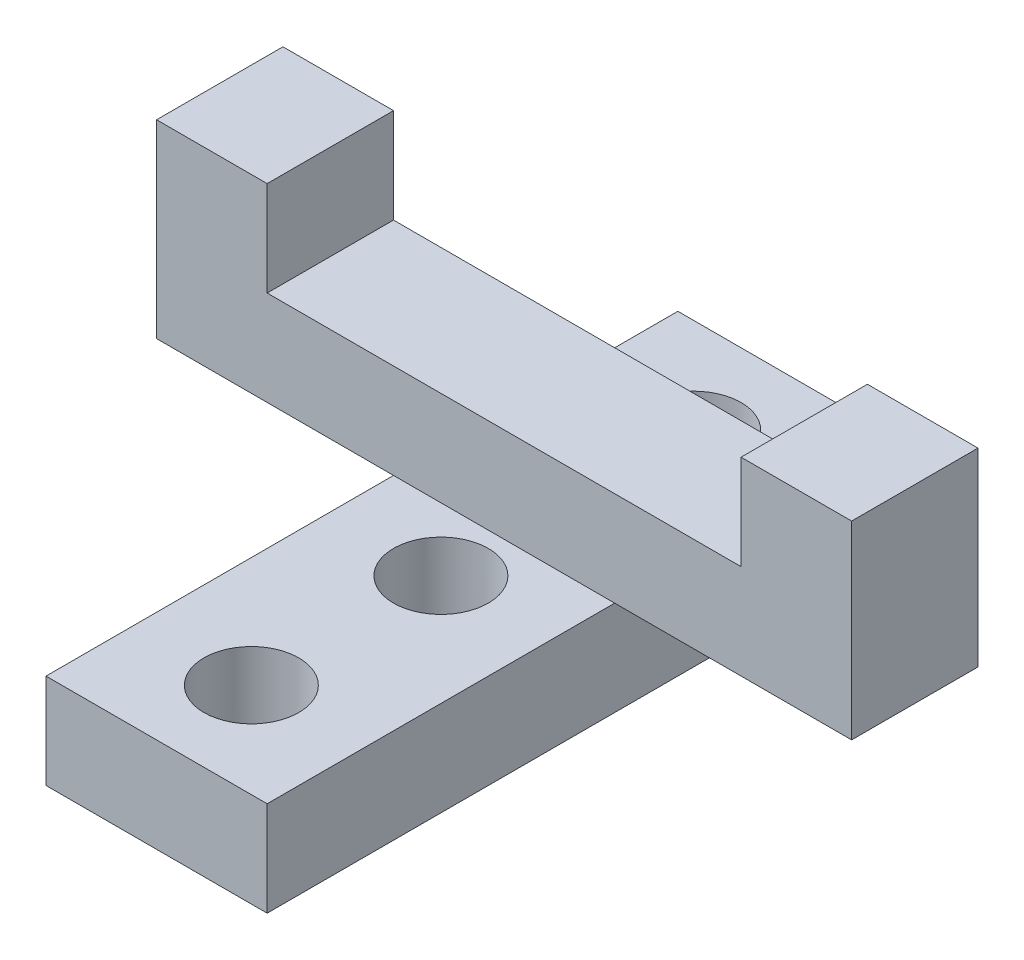
ISO-10303-21;
HEADER;
FILE_DESCRIPTION(('STEP AP214'),'2;1');
FILE_NAME('part.step','',(''),(''),'','','');
FILE_SCHEMA(('AUTOMOTIVE_DESIGN { 1 0 10303 214 1 1 1 1 }'));
ENDSEC;
DATA;
#1=APPLICATION_CONTEXT('core data for automotive mechanical design processes');
#2=APPLICATION_PROTOCOL_DEFINITION('international standard','automotive_design',2000,#1);
#3=PRODUCT_CONTEXT('',#1,'mechanical');
#4=PRODUCT('Part','Part','',(#3));
#5=PRODUCT_RELATED_PRODUCT_CATEGORY('part','',(#4));
#6=PRODUCT_DEFINITION_FORMATION('','',#4);
#7=PRODUCT_DEFINITION_CONTEXT('part definition',#1,'design');
#8=PRODUCT_DEFINITION('design','',#6,#7);
#9=PRODUCT_DEFINITION_SHAPE('','',#8);
#10=(LENGTH_UNIT() NAMED_UNIT(*) SI_UNIT(.MILLI.,.METRE.));
#11=(NAMED_UNIT(*) PLANE_ANGLE_UNIT() SI_UNIT($,.RADIAN.));
#12=(NAMED_UNIT(*) SI_UNIT($,.STERADIAN.) SOLID_ANGLE_UNIT());
#13=UNCERTAINTY_MEASURE_WITH_UNIT(LENGTH_MEASURE(1.E-05),#10,'distance_accuracy_value','');
#14=(GEOMETRIC_REPRESENTATION_CONTEXT(3) GLOBAL_UNCERTAINTY_ASSIGNED_CONTEXT((#13)) GLOBAL_UNIT_ASSIGNED_CONTEXT((#10,
#11,#12)) REPRESENTATION_CONTEXT('',''));
#15=CARTESIAN_POINT('',(0.,0.,0.));
#16=DIRECTION('',(0.,0.,1.));
#17=DIRECTION('',(1.,0.,0.));
#18=AXIS2_PLACEMENT_3D('',#15,#16,#17);
#19=CARTESIAN_POINT('',(-3.5,9.,-1.00000000000001));
#20=DIRECTION('',(0.,1.,0.));
#21=DIRECTION('',(0.,0.,1.));
#22=AXIS2_PLACEMENT_3D('',#19,#20,#21);
#23=PLANE('',#22);
#24=DIRECTION('',(0.,0.,1.));
#25=VECTOR('',#24,1.);
#26=CARTESIAN_POINT('',(-7.5,9.,-5.00000000000001));
#27=LINE('',#26,#25);
#28=CARTESIAN_POINT('',(-7.5,9.,-5.00000000000001));
#29=VERTEX_POINT('',#28);
#30=CARTESIAN_POINT('',(-7.5,9.,-1.));
#31=VERTEX_POINT('',#30);
#32=EDGE_CURVE('E140',#29,#31,#27,.T.);
#33=ORIENTED_EDGE('',*,*,#32,.F.);
#34=DIRECTION('',(-1.,0.,0.));
#35=VECTOR('',#34,1.);
#36=CARTESIAN_POINT('',(-3.5,9.,-5.00000000000001));
#37=LINE('',#36,#35);
#38=CARTESIAN_POINT('',(-11.,9.,-5.00000000000001));
#39=VERTEX_POINT('',#38);
#40=EDGE_CURVE('E222',#29,#39,#37,.T.);
#41=ORIENTED_EDGE('',*,*,#40,.T.);
#42=DIRECTION('',(0.,0.,-1.));
#43=VECTOR('',#42,1.);
#44=CARTESIAN_POINT('',(-11.,9.,-1.));
#45=LINE('',#44,#43);
#46=CARTESIAN_POINT('',(-11.,9.,-1.));
#47=VERTEX_POINT('',#46);
#48=EDGE_CURVE('E173',#47,#39,#45,.T.);
#49=ORIENTED_EDGE('',*,*,#48,.F.);
#50=DIRECTION('',(1.,0.,0.));
#51=VECTOR('',#50,1.);
#52=CARTESIAN_POINT('',(-3.5,9.,-1.00000000000001));
#53=LINE('',#52,#51);
#54=EDGE_CURVE('E220',#47,#31,#53,.T.);
#55=ORIENTED_EDGE('',*,*,#54,.T.);
#56=EDGE_LOOP('',(#33,#41,#49,#55));
#57=FACE_BOUND('',#56,.T.);
#58=ADVANCED_FACE('F31',(#57),#23,.T.);
#59=CARTESIAN_POINT('',(-3.5,3.,9.99999999999999));
#60=DIRECTION('',(1.,0.,0.));
#61=DIRECTION('',(0.,0.,-1.));
#62=AXIS2_PLACEMENT_3D('',#59,#60,#61);
#63=PLANE('',#62);
#64=DIRECTION('',(0.,0.,1.));
#65=VECTOR('',#64,1.);
#66=CARTESIAN_POINT('',(-3.5,3.,-1.));
#67=LINE('',#66,#65);
#68=CARTESIAN_POINT('',(-3.5,3.,-5.));
#69=VERTEX_POINT('',#68);
#70=CARTESIAN_POINT('',(-3.5,3.,-1.));
#71=VERTEX_POINT('',#70);
#72=EDGE_CURVE('E56',#69,#71,#67,.T.);
#73=ORIENTED_EDGE('',*,*,#72,.F.);
#74=DIRECTION('',(0.,0.,1.));
#75=VECTOR('',#74,1.);
#76=CARTESIAN_POINT('',(-3.5,3.,9.99999999999999));
#77=LINE('',#76,#75);
#78=CARTESIAN_POINT('',(-3.5,3.,-10.));
#79=VERTEX_POINT('',#78);
#80=EDGE_CURVE('E238',#79,#69,#77,.T.);
#81=ORIENTED_EDGE('',*,*,#80,.F.);
#82=DIRECTION('',(0.,-1.,0.));
#83=VECTOR('',#82,1.);
#84=CARTESIAN_POINT('',(-3.5,3.,-10.));
#85=LINE('',#84,#83);
#86=CARTESIAN_POINT('',(-3.5,0.,-10.));
#87=VERTEX_POINT('',#86);
#88=EDGE_CURVE('E40',#79,#87,#85,.T.);
#89=ORIENTED_EDGE('',*,*,#88,.T.);
#90=DIRECTION('',(0.,0.,1.));
#91=VECTOR('',#90,1.);
#92=CARTESIAN_POINT('',(-3.5,0.,9.99999999999999));
#93=LINE('',#92,#91);
#94=CARTESIAN_POINT('',(-3.5,0.,9.99999999999999));
#95=VERTEX_POINT('',#94);
#96=EDGE_CURVE('E255',#87,#95,#93,.T.);
#97=ORIENTED_EDGE('',*,*,#96,.T.);
#98=DIRECTION('',(0.,-1.,0.));
#99=VECTOR('',#98,1.);
#100=CARTESIAN_POINT('',(-3.5,3.,9.99999999999999));
#101=LINE('',#100,#99);
#102=CARTESIAN_POINT('',(-3.5,3.,9.99999999999999));
#103=VERTEX_POINT('',#102);
#104=EDGE_CURVE('E262',#103,#95,#101,.T.);
#105=ORIENTED_EDGE('',*,*,#104,.F.);
#106=EDGE_CURVE('E235',#71,#103,#77,.T.);
#107=ORIENTED_EDGE('',*,*,#106,.F.);
#108=EDGE_LOOP('',(#73,#81,#89,#97,#105,#107));
#109=FACE_BOUND('',#108,.T.);
#110=ADVANCED_FACE('F336',(#109),#63,.F.);
#111=CARTESIAN_POINT('',(3.5,3.,9.99999999999999));
#112=DIRECTION('',(-1.,0.,0.));
#113=DIRECTION('',(0.,0.,1.));
#114=AXIS2_PLACEMENT_3D('',#111,#112,#113);
#115=PLANE('',#114);
#116=DIRECTION('',(0.,0.,-1.));
#117=VECTOR('',#116,1.);
#118=CARTESIAN_POINT('',(3.5,3.,-1.));
#119=LINE('',#118,#117);
#120=CARTESIAN_POINT('',(3.5,3.,-1.));
#121=VERTEX_POINT('',#120);
#122=CARTESIAN_POINT('',(3.5,3.,-5.00000000000001));
#123=VERTEX_POINT('',#122);
#124=EDGE_CURVE('E195',#121,#123,#119,.T.);
#125=ORIENTED_EDGE('',*,*,#124,.F.);
#126=DIRECTION('',(0.,0.,-1.));
#127=VECTOR('',#126,1.);
#128=CARTESIAN_POINT('',(3.5,3.,9.99999999999999));
#129=LINE('',#128,#127);
#130=CARTESIAN_POINT('',(3.5,3.,9.99999999999999));
#131=VERTEX_POINT('',#130);
#132=EDGE_CURVE('E277',#131,#121,#129,.T.);
#133=ORIENTED_EDGE('',*,*,#132,.F.);
#134=DIRECTION('',(0.,-1.,0.));
#135=VECTOR('',#134,1.);
#136=CARTESIAN_POINT('',(3.5,3.,9.99999999999999));
#137=LINE('',#136,#135);
#138=CARTESIAN_POINT('',(3.5,0.,9.99999999999999));
#139=VERTEX_POINT('',#138);
#140=EDGE_CURVE('E248',#131,#139,#137,.T.);
#141=ORIENTED_EDGE('',*,*,#140,.T.);
#142=DIRECTION('',(0.,0.,-1.));
#143=VECTOR('',#142,1.);
#144=CARTESIAN_POINT('',(3.5,0.,9.99999999999999));
#145=LINE('',#144,#143);
#146=CARTESIAN_POINT('',(3.5,0.,-10.));
#147=VERTEX_POINT('',#146);
#148=EDGE_CURVE('E249',#139,#147,#145,.T.);
#149=ORIENTED_EDGE('',*,*,#148,.T.);
#150=DIRECTION('',(0.,-1.,0.));
#151=VECTOR('',#150,1.);
#152=CARTESIAN_POINT('',(3.5,3.,-10.));
#153=LINE('',#152,#151);
#154=CARTESIAN_POINT('',(3.5,3.,-10.));
#155=VERTEX_POINT('',#154);
#156=EDGE_CURVE('E11',#155,#147,#153,.T.);
#157=ORIENTED_EDGE('',*,*,#156,.F.);
#158=EDGE_CURVE('E259',#123,#155,#129,.T.);
#159=ORIENTED_EDGE('',*,*,#158,.F.);
#160=EDGE_LOOP('',(#125,#133,#141,#149,#157,#159));
#161=FACE_BOUND('',#160,.T.);
#162=ADVANCED_FACE('F33',(#161),#115,.F.);
#163=CARTESIAN_POINT('',(3.5,3.,-10.));
#164=DIRECTION('',(0.,-1.,0.));
#165=DIRECTION('',(0.,0.,-1.));
#166=AXIS2_PLACEMENT_3D('',#163,#164,#165);
#167=PLANE('',#166);
#168=CARTESIAN_POINT('',(0.,3.,-7.));
#169=DIRECTION('',(0.,1.,0.));
#170=DIRECTION('',(0.,0.,1.));
#171=AXIS2_PLACEMENT_3D('',#168,#169,#170);
#172=CIRCLE('',#171,1.5);
#173=CARTESIAN_POINT('',(0.,3.,-5.50000000000001));
#174=VERTEX_POINT('',#173);
#175=EDGE_CURVE('E269',#174,#174,#172,.T.);
#176=ORIENTED_EDGE('',*,*,#175,.F.);
#177=EDGE_LOOP('',(#176));
#178=FACE_BOUND('',#177,.T.);
#179=DIRECTION('',(-1.,0.,0.));
#180=VECTOR('',#179,1.);
#181=CARTESIAN_POINT('',(-3.5,3.,-5.00000000000001));
#182=LINE('',#181,#180);
#183=EDGE_CURVE('E210',#123,#69,#182,.T.);
#184=ORIENTED_EDGE('',*,*,#183,.F.);
#185=ORIENTED_EDGE('',*,*,#158,.T.);
#186=DIRECTION('',(-1.,0.,0.));
#187=VECTOR('',#186,1.);
#188=CARTESIAN_POINT('',(-3.5,3.,-10.));
#189=LINE('',#188,#187);
#190=EDGE_CURVE('E239',#155,#79,#189,.T.);
#191=ORIENTED_EDGE('',*,*,#190,.T.);
#192=ORIENTED_EDGE('',*,*,#80,.T.);
#193=EDGE_LOOP('',(#184,#185,#191,#192));
#194=FACE_BOUND('',#193,.T.);
#195=ADVANCED_FACE('F294',(#178,#194),#167,.F.);
#196=CARTESIAN_POINT('',(0.,3.,0.999999999999995));
#197=DIRECTION('',(0.,1.,0.));
#198=DIRECTION('',(0.,0.,1.));
#199=AXIS2_PLACEMENT_3D('',#196,#197,#198);
#200=CIRCLE('',#199,1.5);
#201=CARTESIAN_POINT('',(0.,3.,2.49999999999999));
#202=VERTEX_POINT('',#201);
#203=EDGE_CURVE('E273',#202,#202,#200,.T.);
#204=ORIENTED_EDGE('',*,*,#203,.F.);
#205=EDGE_LOOP('',(#204));
#206=FACE_BOUND('',#205,.T.);
#207=CARTESIAN_POINT('',(0.,3.,6.99999999999999));
#208=DIRECTION('',(0.,1.,0.));
#209=DIRECTION('',(0.,0.,1.));
#210=AXIS2_PLACEMENT_3D('',#207,#208,#209);
#211=CIRCLE('',#210,1.5);
#212=CARTESIAN_POINT('',(0.,3.,8.49999999999999));
#213=VERTEX_POINT('',#212);
#214=EDGE_CURVE('E227',#213,#213,#211,.T.);
#215=ORIENTED_EDGE('',*,*,#214,.F.);
#216=EDGE_LOOP('',(#215));
#217=FACE_BOUND('',#216,.T.);
#218=DIRECTION('',(1.,0.,0.));
#219=VECTOR('',#218,1.);
#220=CARTESIAN_POINT('',(-3.5,3.,-1.00000000000001));
#221=LINE('',#220,#219);
#222=EDGE_CURVE('E231',#71,#121,#221,.T.);
#223=ORIENTED_EDGE('',*,*,#222,.F.);
#224=ORIENTED_EDGE('',*,*,#106,.T.);
#225=DIRECTION('',(1.,0.,0.));
#226=VECTOR('',#225,1.);
#227=CARTESIAN_POINT('',(-3.5,3.,9.99999999999999));
#228=LINE('',#227,#226);
#229=EDGE_CURVE('E245',#103,#131,#228,.T.);
#230=ORIENTED_EDGE('',*,*,#229,.T.);
#231=ORIENTED_EDGE('',*,*,#132,.T.);
#232=EDGE_LOOP('',(#223,#224,#230,#231));
#233=FACE_BOUND('',#232,.T.);
#234=ADVANCED_FACE('F290',(#206,#217,#233),#167,.F.);
#235=CARTESIAN_POINT('',(-3.5,3.,-10.));
#236=DIRECTION('',(0.,0.,1.));
#237=DIRECTION('',(1.,0.,0.));
#238=AXIS2_PLACEMENT_3D('',#235,#236,#237);
#239=PLANE('',#238);
#240=DIRECTION('',(-1.,0.,0.));
#241=VECTOR('',#240,1.);
#242=CARTESIAN_POINT('',(-3.5,0.,-10.));
#243=LINE('',#242,#241);
#244=EDGE_CURVE('E252',#147,#87,#243,.T.);
#245=ORIENTED_EDGE('',*,*,#244,.T.);
#246=ORIENTED_EDGE('',*,*,#88,.F.);
#247=ORIENTED_EDGE('',*,*,#190,.F.);
#248=ORIENTED_EDGE('',*,*,#156,.T.);
#249=EDGE_LOOP('',(#245,#246,#247,#248));
#250=FACE_BOUND('',#249,.T.);
#251=ADVANCED_FACE('F293',(#250),#239,.F.);
#252=CARTESIAN_POINT('',(-3.5,3.,9.99999999999999));
#253=DIRECTION('',(0.,0.,-1.));
#254=DIRECTION('',(-1.,0.,0.));
#255=AXIS2_PLACEMENT_3D('',#252,#253,#254);
#256=PLANE('',#255);
#257=DIRECTION('',(1.,0.,0.));
#258=VECTOR('',#257,1.);
#259=CARTESIAN_POINT('',(-3.5,0.,9.99999999999999));
#260=LINE('',#259,#258);
#261=EDGE_CURVE('E257',#95,#139,#260,.T.);
#262=ORIENTED_EDGE('',*,*,#261,.T.);
#263=ORIENTED_EDGE('',*,*,#140,.F.);
#264=ORIENTED_EDGE('',*,*,#229,.F.);
#265=ORIENTED_EDGE('',*,*,#104,.T.);
#266=EDGE_LOOP('',(#262,#263,#264,#265));
#267=FACE_BOUND('',#266,.T.);
#268=ADVANCED_FACE('F371',(#267),#256,.F.);
#269=CARTESIAN_POINT('',(3.5,0.,-10.));
#270=DIRECTION('',(0.,-1.,0.));
#271=DIRECTION('',(0.,0.,-1.));
#272=AXIS2_PLACEMENT_3D('',#269,#270,#271);
#273=PLANE('',#272);
#274=CARTESIAN_POINT('',(0.,0.,6.99999999999999));
#275=DIRECTION('',(0.,-1.,0.));
#276=DIRECTION('',(0.,0.,-1.));
#277=AXIS2_PLACEMENT_3D('',#274,#275,#276);
#278=CIRCLE('',#277,1.5);
#279=CARTESIAN_POINT('',(0.,0.,5.5));
#280=VERTEX_POINT('',#279);
#281=EDGE_CURVE('E274',#280,#280,#278,.T.);
#282=ORIENTED_EDGE('',*,*,#281,.F.);
#283=EDGE_LOOP('',(#282));
#284=FACE_BOUND('',#283,.T.);
#285=CARTESIAN_POINT('',(0.,0.,0.999999999999995));
#286=DIRECTION('',(0.,-1.,0.));
#287=DIRECTION('',(0.,0.,-1.));
#288=AXIS2_PLACEMENT_3D('',#285,#286,#287);
#289=CIRCLE('',#288,1.5);
#290=CARTESIAN_POINT('',(0.,0.,-0.500000000000003));
#291=VERTEX_POINT('',#290);
#292=EDGE_CURVE('E270',#291,#291,#289,.T.);
#293=ORIENTED_EDGE('',*,*,#292,.F.);
#294=EDGE_LOOP('',(#293));
#295=FACE_BOUND('',#294,.T.);
#296=CARTESIAN_POINT('',(0.,0.,-7.));
#297=DIRECTION('',(0.,-1.,0.));
#298=DIRECTION('',(0.,0.,-1.));
#299=AXIS2_PLACEMENT_3D('',#296,#297,#298);
#300=CIRCLE('',#299,1.5);
#301=CARTESIAN_POINT('',(0.,0.,-8.5));
#302=VERTEX_POINT('',#301);
#303=EDGE_CURVE('E253',#302,#302,#300,.T.);
#304=ORIENTED_EDGE('',*,*,#303,.F.);
#305=EDGE_LOOP('',(#304));
#306=FACE_BOUND('',#305,.T.);
#307=ORIENTED_EDGE('',*,*,#148,.F.);
#308=ORIENTED_EDGE('',*,*,#261,.F.);
#309=ORIENTED_EDGE('',*,*,#96,.F.);
#310=ORIENTED_EDGE('',*,*,#244,.F.);
#311=EDGE_LOOP('',(#307,#308,#309,#310));
#312=FACE_BOUND('',#311,.T.);
#313=ADVANCED_FACE('F364',(#284,#295,#306,#312),#273,.T.);
#314=CARTESIAN_POINT('',(0.,3.,-7.));
#315=DIRECTION('',(0.,1.,0.));
#316=DIRECTION('',(0.,0.,1.));
#317=AXIS2_PLACEMENT_3D('',#314,#315,#316);
#318=CYLINDRICAL_SURFACE('',#317,1.5);
#319=ORIENTED_EDGE('',*,*,#303,.T.);
#320=EDGE_LOOP('',(#319));
#321=FACE_BOUND('',#320,.T.);
#322=ORIENTED_EDGE('',*,*,#175,.T.);
#323=EDGE_LOOP('',(#322));
#324=FACE_BOUND('',#323,.T.);
#325=ADVANCED_FACE('F361',(#321,#324),#318,.F.);
#326=CARTESIAN_POINT('',(0.,3.,0.999999999999995));
#327=DIRECTION('',(0.,1.,0.));
#328=DIRECTION('',(0.,0.,1.));
#329=AXIS2_PLACEMENT_3D('',#326,#327,#328);
#330=CYLINDRICAL_SURFACE('',#329,1.5);
#331=ORIENTED_EDGE('',*,*,#292,.T.);
#332=EDGE_LOOP('',(#331));
#333=FACE_BOUND('',#332,.T.);
#334=ORIENTED_EDGE('',*,*,#203,.T.);
#335=EDGE_LOOP('',(#334));
#336=FACE_BOUND('',#335,.T.);
#337=ADVANCED_FACE('F357',(#333,#336),#330,.F.);
#338=CARTESIAN_POINT('',(0.,3.,6.99999999999999));
#339=DIRECTION('',(0.,1.,0.));
#340=DIRECTION('',(0.,0.,1.));
#341=AXIS2_PLACEMENT_3D('',#338,#339,#340);
#342=CYLINDRICAL_SURFACE('',#341,1.5);
#343=ORIENTED_EDGE('',*,*,#281,.T.);
#344=EDGE_LOOP('',(#343));
#345=FACE_BOUND('',#344,.T.);
#346=ORIENTED_EDGE('',*,*,#214,.T.);
#347=EDGE_LOOP('',(#346));
#348=FACE_BOUND('',#347,.T.);
#349=ADVANCED_FACE('F288',(#345,#348),#342,.F.);
#350=CARTESIAN_POINT('',(-3.5,9.,-1.00000000000001));
#351=DIRECTION('',(0.,0.,-1.));
#352=DIRECTION('',(-1.,0.,0.));
#353=AXIS2_PLACEMENT_3D('',#350,#351,#352);
#354=PLANE('',#353);
#355=DIRECTION('',(1.,0.,0.));
#356=VECTOR('',#355,1.);
#357=CARTESIAN_POINT('',(-7.5,6.,-1.));
#358=LINE('',#357,#356);
#359=CARTESIAN_POINT('',(-7.5,6.,-1.));
#360=VERTEX_POINT('',#359);
#361=CARTESIAN_POINT('',(7.5,6.,-1.));
#362=VERTEX_POINT('',#361);
#363=EDGE_CURVE('E150',#360,#362,#358,.T.);
#364=ORIENTED_EDGE('',*,*,#363,.F.);
#365=DIRECTION('',(0.,1.,0.));
#366=VECTOR('',#365,1.);
#367=CARTESIAN_POINT('',(-7.5,6.,-1.));
#368=LINE('',#367,#366);
#369=EDGE_CURVE('E134',#360,#31,#368,.T.);
#370=ORIENTED_EDGE('',*,*,#369,.T.);
#371=ORIENTED_EDGE('',*,*,#54,.F.);
#372=DIRECTION('',(0.,1.,0.));
#373=VECTOR('',#372,1.);
#374=CARTESIAN_POINT('',(-11.,3.,-1.));
#375=LINE('',#374,#373);
#376=CARTESIAN_POINT('',(-11.,3.,-1.));
#377=VERTEX_POINT('',#376);
#378=EDGE_CURVE('E170',#377,#47,#375,.T.);
#379=ORIENTED_EDGE('',*,*,#378,.F.);
#380=DIRECTION('',(1.,0.,0.));
#381=VECTOR('',#380,1.);
#382=CARTESIAN_POINT('',(-11.,3.,-1.));
#383=LINE('',#382,#381);
#384=EDGE_CURVE('E180',#377,#71,#383,.T.);
#385=ORIENTED_EDGE('',*,*,#384,.T.);
#386=ORIENTED_EDGE('',*,*,#222,.T.);
#387=DIRECTION('',(-1.,0.,0.));
#388=VECTOR('',#387,1.);
#389=CARTESIAN_POINT('',(11.,3.,-1.));
#390=LINE('',#389,#388);
#391=CARTESIAN_POINT('',(11.,3.,-1.));
#392=VERTEX_POINT('',#391);
#393=EDGE_CURVE('E234',#392,#121,#390,.T.);
#394=ORIENTED_EDGE('',*,*,#393,.F.);
#395=DIRECTION('',(0.,-1.,0.));
#396=VECTOR('',#395,1.);
#397=CARTESIAN_POINT('',(11.,3.,-1.));
#398=LINE('',#397,#396);
#399=CARTESIAN_POINT('',(11.,9.,-1.));
#400=VERTEX_POINT('',#399);
#401=EDGE_CURVE('E183',#400,#392,#398,.T.);
#402=ORIENTED_EDGE('',*,*,#401,.F.);
#403=CARTESIAN_POINT('',(7.5,9.,-1.));
#404=VERTEX_POINT('',#403);
#405=EDGE_CURVE('E223',#404,#400,#53,.T.);
#406=ORIENTED_EDGE('',*,*,#405,.F.);
#407=DIRECTION('',(0.,1.,0.));
#408=VECTOR('',#407,1.);
#409=CARTESIAN_POINT('',(7.5,6.,-1.));
#410=LINE('',#409,#408);
#411=EDGE_CURVE('E48',#362,#404,#410,.T.);
#412=ORIENTED_EDGE('',*,*,#411,.F.);
#413=EDGE_LOOP('',(#364,#370,#371,#379,#385,#386,#394,#402,#406,#412));
#414=FACE_BOUND('',#413,.T.);
#415=ADVANCED_FACE('F155',(#414),#354,.F.);
#416=CARTESIAN_POINT('',(-3.5,9.,-5.00000000000001));
#417=DIRECTION('',(0.,0.,1.));
#418=DIRECTION('',(1.,0.,0.));
#419=AXIS2_PLACEMENT_3D('',#416,#417,#418);
#420=PLANE('',#419);
#421=ORIENTED_EDGE('',*,*,#40,.F.);
#422=DIRECTION('',(0.,1.,0.));
#423=VECTOR('',#422,1.);
#424=CARTESIAN_POINT('',(-7.5,6.,-5.00000000000001));
#425=LINE('',#424,#423);
#426=CARTESIAN_POINT('',(-7.5,6.,-5.00000000000001));
#427=VERTEX_POINT('',#426);
#428=EDGE_CURVE('E164',#427,#29,#425,.T.);
#429=ORIENTED_EDGE('',*,*,#428,.F.);
#430=DIRECTION('',(-1.,0.,0.));
#431=VECTOR('',#430,1.);
#432=CARTESIAN_POINT('',(-7.5,6.,-5.00000000000001));
#433=LINE('',#432,#431);
#434=CARTESIAN_POINT('',(7.5,6.,-5.00000000000001));
#435=VERTEX_POINT('',#434);
#436=EDGE_CURVE('E144',#435,#427,#433,.T.);
#437=ORIENTED_EDGE('',*,*,#436,.F.);
#438=DIRECTION('',(0.,1.,0.));
#439=VECTOR('',#438,1.);
#440=CARTESIAN_POINT('',(7.5,6.,-5.00000000000001));
#441=LINE('',#440,#439);
#442=CARTESIAN_POINT('',(7.5,9.,-5.00000000000001));
#443=VERTEX_POINT('',#442);
#444=EDGE_CURVE('E166',#435,#443,#441,.T.);
#445=ORIENTED_EDGE('',*,*,#444,.T.);
#446=CARTESIAN_POINT('',(11.,9.,-5.00000000000001));
#447=VERTEX_POINT('',#446);
#448=EDGE_CURVE('E224',#447,#443,#37,.T.);
#449=ORIENTED_EDGE('',*,*,#448,.F.);
#450=DIRECTION('',(0.,1.,0.));
#451=VECTOR('',#450,1.);
#452=CARTESIAN_POINT('',(11.,3.,-5.00000000000001));
#453=LINE('',#452,#451);
#454=CARTESIAN_POINT('',(11.,3.,-5.00000000000001));
#455=VERTEX_POINT('',#454);
#456=EDGE_CURVE('E323',#455,#447,#453,.T.);
#457=ORIENTED_EDGE('',*,*,#456,.F.);
#458=DIRECTION('',(-1.,0.,0.));
#459=VECTOR('',#458,1.);
#460=CARTESIAN_POINT('',(11.,3.,-5.00000000000001));
#461=LINE('',#460,#459);
#462=EDGE_CURVE('E213',#455,#123,#461,.T.);
#463=ORIENTED_EDGE('',*,*,#462,.T.);
#464=ORIENTED_EDGE('',*,*,#183,.T.);
#465=DIRECTION('',(1.,0.,0.));
#466=VECTOR('',#465,1.);
#467=CARTESIAN_POINT('',(-11.,3.,-5.00000000000001));
#468=LINE('',#467,#466);
#469=CARTESIAN_POINT('',(-11.,3.,-5.00000000000001));
#470=VERTEX_POINT('',#469);
#471=EDGE_CURVE('E192',#470,#69,#468,.T.);
#472=ORIENTED_EDGE('',*,*,#471,.F.);
#473=DIRECTION('',(0.,-1.,0.));
#474=VECTOR('',#473,1.);
#475=CARTESIAN_POINT('',(-11.,3.,-5.00000000000001));
#476=LINE('',#475,#474);
#477=EDGE_CURVE('E176',#39,#470,#476,.T.);
#478=ORIENTED_EDGE('',*,*,#477,.F.);
#479=EDGE_LOOP('',(#421,#429,#437,#445,#449,#457,#463,#464,#472,#478));
#480=FACE_BOUND('',#479,.T.);
#481=ADVANCED_FACE('F311',(#480),#420,.F.);
#482=DIRECTION('',(0.,0.,-1.));
#483=VECTOR('',#482,1.);
#484=CARTESIAN_POINT('',(7.5,9.,-5.00000000000001));
#485=LINE('',#484,#483);
#486=EDGE_CURVE('E153',#404,#443,#485,.T.);
#487=ORIENTED_EDGE('',*,*,#486,.F.);
#488=ORIENTED_EDGE('',*,*,#405,.T.);
#489=DIRECTION('',(0.,0.,1.));
#490=VECTOR('',#489,1.);
#491=CARTESIAN_POINT('',(11.,9.,-1.));
#492=LINE('',#491,#490);
#493=EDGE_CURVE('E218',#447,#400,#492,.T.);
#494=ORIENTED_EDGE('',*,*,#493,.F.);
#495=ORIENTED_EDGE('',*,*,#448,.T.);
#496=EDGE_LOOP('',(#487,#488,#494,#495));
#497=FACE_BOUND('',#496,.T.);
#498=ADVANCED_FACE('F318',(#497),#23,.T.);
#499=CARTESIAN_POINT('',(11.,3.,-1.));
#500=DIRECTION('',(0.,1.,0.));
#501=DIRECTION('',(0.,0.,1.));
#502=AXIS2_PLACEMENT_3D('',#499,#500,#501);
#503=PLANE('',#502);
#504=ORIENTED_EDGE('',*,*,#124,.T.);
#505=ORIENTED_EDGE('',*,*,#462,.F.);
#506=DIRECTION('',(0.,0.,-1.));
#507=VECTOR('',#506,1.);
#508=CARTESIAN_POINT('',(11.,3.,-1.));
#509=LINE('',#508,#507);
#510=EDGE_CURVE('E206',#392,#455,#509,.T.);
#511=ORIENTED_EDGE('',*,*,#510,.F.);
#512=ORIENTED_EDGE('',*,*,#393,.T.);
#513=EDGE_LOOP('',(#504,#505,#511,#512));
#514=FACE_BOUND('',#513,.T.);
#515=ADVANCED_FACE('F325',(#514),#503,.F.);
#516=CARTESIAN_POINT('',(11.,9.,-1.));
#517=DIRECTION('',(-1.,0.,0.));
#518=DIRECTION('',(0.,0.,1.));
#519=AXIS2_PLACEMENT_3D('',#516,#517,#518);
#520=PLANE('',#519);
#521=ORIENTED_EDGE('',*,*,#401,.T.);
#522=ORIENTED_EDGE('',*,*,#510,.T.);
#523=ORIENTED_EDGE('',*,*,#456,.T.);
#524=ORIENTED_EDGE('',*,*,#493,.T.);
#525=EDGE_LOOP('',(#521,#522,#523,#524));
#526=FACE_BOUND('',#525,.T.);
#527=ADVANCED_FACE('F322',(#526),#520,.F.);
#528=CARTESIAN_POINT('',(-11.,3.,-1.));
#529=DIRECTION('',(0.,1.,0.));
#530=DIRECTION('',(0.,0.,1.));
#531=AXIS2_PLACEMENT_3D('',#528,#529,#530);
#532=PLANE('',#531);
#533=ORIENTED_EDGE('',*,*,#72,.T.);
#534=ORIENTED_EDGE('',*,*,#384,.F.);
#535=DIRECTION('',(0.,0.,1.));
#536=VECTOR('',#535,1.);
#537=CARTESIAN_POINT('',(-11.,3.,-1.));
#538=LINE('',#537,#536);
#539=EDGE_CURVE('E178',#470,#377,#538,.T.);
#540=ORIENTED_EDGE('',*,*,#539,.F.);
#541=ORIENTED_EDGE('',*,*,#471,.T.);
#542=EDGE_LOOP('',(#533,#534,#540,#541));
#543=FACE_BOUND('',#542,.T.);
#544=ADVANCED_FACE('F302',(#543),#532,.F.);
#545=CARTESIAN_POINT('',(-11.,9.,-1.));
#546=DIRECTION('',(-1.,0.,0.));
#547=DIRECTION('',(0.,0.,1.));
#548=AXIS2_PLACEMENT_3D('',#545,#546,#547);
#549=PLANE('',#548);
#550=ORIENTED_EDGE('',*,*,#378,.T.);
#551=ORIENTED_EDGE('',*,*,#48,.T.);
#552=ORIENTED_EDGE('',*,*,#477,.T.);
#553=ORIENTED_EDGE('',*,*,#539,.T.);
#554=EDGE_LOOP('',(#550,#551,#552,#553));
#555=FACE_BOUND('',#554,.T.);
#556=ADVANCED_FACE('F306',(#555),#549,.T.);
#557=CARTESIAN_POINT('',(-7.5,6.,-5.00000000000001));
#558=DIRECTION('',(-1.,0.,0.));
#559=DIRECTION('',(0.,0.,1.));
#560=AXIS2_PLACEMENT_3D('',#557,#558,#559);
#561=PLANE('',#560);
#562=ORIENTED_EDGE('',*,*,#32,.T.);
#563=ORIENTED_EDGE('',*,*,#369,.F.);
#564=DIRECTION('',(0.,0.,1.));
#565=VECTOR('',#564,1.);
#566=CARTESIAN_POINT('',(-7.5,6.,-5.00000000000001));
#567=LINE('',#566,#565);
#568=EDGE_CURVE('E137',#427,#360,#567,.T.);
#569=ORIENTED_EDGE('',*,*,#568,.F.);
#570=ORIENTED_EDGE('',*,*,#428,.T.);
#571=EDGE_LOOP('',(#562,#563,#569,#570));
#572=FACE_BOUND('',#571,.T.);
#573=ADVANCED_FACE('F136',(#572),#561,.F.);
#574=CARTESIAN_POINT('',(7.5,6.,-5.00000000000001));
#575=DIRECTION('',(1.,0.,0.));
#576=DIRECTION('',(0.,0.,-1.));
#577=AXIS2_PLACEMENT_3D('',#574,#575,#576);
#578=PLANE('',#577);
#579=ORIENTED_EDGE('',*,*,#486,.T.);
#580=ORIENTED_EDGE('',*,*,#444,.F.);
#581=DIRECTION('',(0.,0.,-1.));
#582=VECTOR('',#581,1.);
#583=CARTESIAN_POINT('',(7.5,6.,-5.00000000000001));
#584=LINE('',#583,#582);
#585=EDGE_CURVE('E157',#362,#435,#584,.T.);
#586=ORIENTED_EDGE('',*,*,#585,.F.);
#587=ORIENTED_EDGE('',*,*,#411,.T.);
#588=EDGE_LOOP('',(#579,#580,#586,#587));
#589=FACE_BOUND('',#588,.T.);
#590=ADVANCED_FACE('F326',(#589),#578,.F.);
#591=CARTESIAN_POINT('',(-7.5,6.,-1.));
#592=DIRECTION('',(0.,1.,0.));
#593=DIRECTION('',(0.,0.,1.));
#594=AXIS2_PLACEMENT_3D('',#591,#592,#593);
#595=PLANE('',#594);
#596=ORIENTED_EDGE('',*,*,#568,.T.);
#597=ORIENTED_EDGE('',*,*,#363,.T.);
#598=ORIENTED_EDGE('',*,*,#585,.T.);
#599=ORIENTED_EDGE('',*,*,#436,.T.);
#600=EDGE_LOOP('',(#596,#597,#598,#599));
#601=FACE_BOUND('',#600,.T.);
#602=ADVANCED_FACE('F148',(#601),#595,.T.);
#603=CLOSED_SHELL('',(#58,#110,#162,#195,#234,#251,#268,#313,#325,#337,#349,#415,#481,#498,#515,
#527,#544,#556,#573,#590,#602));
#604=MANIFOLD_SOLID_BREP('B2',#603);
#605=ADVANCED_BREP_SHAPE_REPRESENTATION('',(#18,#604),#14);
#606=SHAPE_DEFINITION_REPRESENTATION(#9,#605);
ENDSEC;
END-ISO-10303-21;
